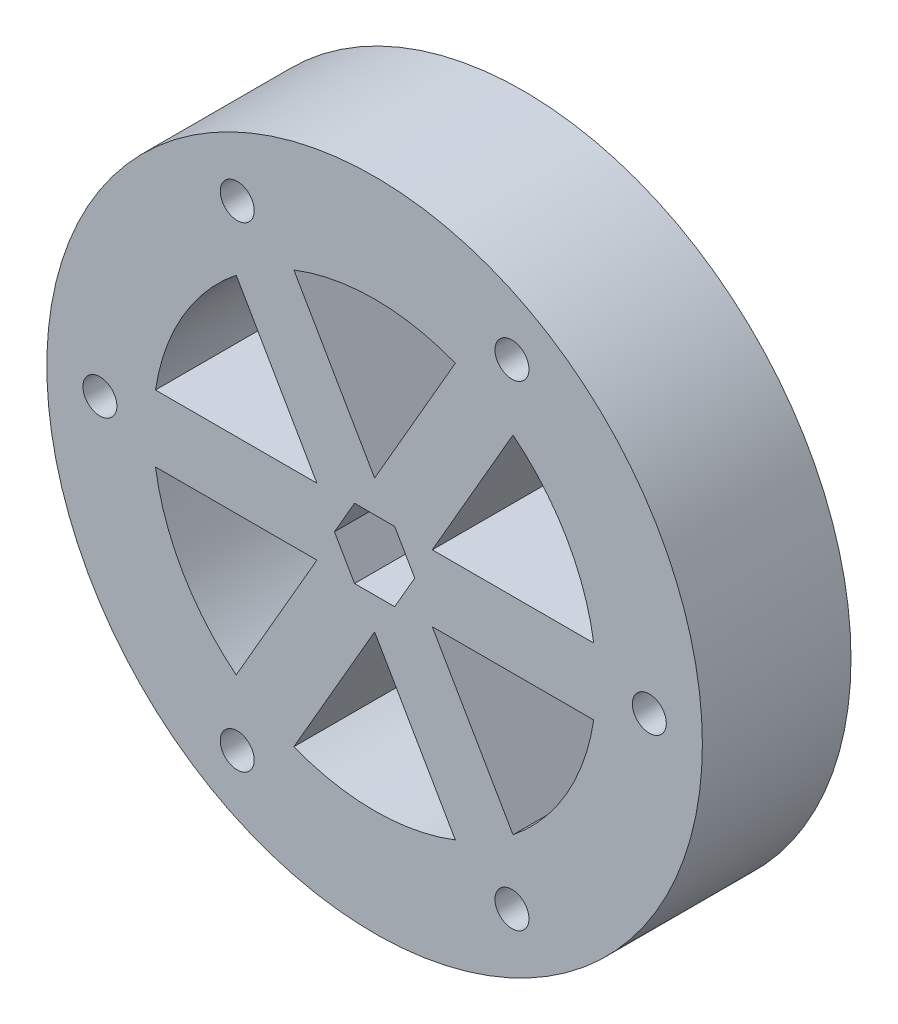
ISO-10303-21;
HEADER;
FILE_DESCRIPTION(('STEP AP214'),'2;1');
FILE_NAME('part.step','',(''),(''),'','','');
FILE_SCHEMA(('AUTOMOTIVE_DESIGN { 1 0 10303 214 1 1 1 1 }'));
ENDSEC;
DATA;
#1=APPLICATION_CONTEXT('core data for automotive mechanical design processes');
#2=APPLICATION_PROTOCOL_DEFINITION('international standard','automotive_design',2000,#1);
#3=PRODUCT_CONTEXT('',#1,'mechanical');
#4=PRODUCT('Part','Part','',(#3));
#5=PRODUCT_RELATED_PRODUCT_CATEGORY('part','',(#4));
#6=PRODUCT_DEFINITION_FORMATION('','',#4);
#7=PRODUCT_DEFINITION_CONTEXT('part definition',#1,'design');
#8=PRODUCT_DEFINITION('design','',#6,#7);
#9=PRODUCT_DEFINITION_SHAPE('','',#8);
#10=(LENGTH_UNIT() NAMED_UNIT(*) SI_UNIT(.MILLI.,.METRE.));
#11=(NAMED_UNIT(*) PLANE_ANGLE_UNIT() SI_UNIT($,.RADIAN.));
#12=(NAMED_UNIT(*) SI_UNIT($,.STERADIAN.) SOLID_ANGLE_UNIT());
#13=UNCERTAINTY_MEASURE_WITH_UNIT(LENGTH_MEASURE(1.E-05),#10,'distance_accuracy_value','');
#14=(GEOMETRIC_REPRESENTATION_CONTEXT(3) GLOBAL_UNCERTAINTY_ASSIGNED_CONTEXT((#13)) GLOBAL_UNIT_ASSIGNED_CONTEXT((#10,
#11,#12)) REPRESENTATION_CONTEXT('',''));
#15=CARTESIAN_POINT('',(0.,0.,0.));
#16=DIRECTION('',(0.,0.,1.));
#17=DIRECTION('',(1.,0.,0.));
#18=AXIS2_PLACEMENT_3D('',#15,#16,#17);
#19=CARTESIAN_POINT('',(0.,0.,14.));
#20=DIRECTION('',(0.,0.,-1.));
#21=DIRECTION('',(-1.,0.,0.));
#22=AXIS2_PLACEMENT_3D('',#19,#20,#21);
#23=CYLINDRICAL_SURFACE('',#22,30.8803961678998);
#24=CARTESIAN_POINT('',(0.,0.,14.));
#25=DIRECTION('',(0.,0.,1.));
#26=DIRECTION('',(1.,0.,0.));
#27=AXIS2_PLACEMENT_3D('',#24,#25,#26);
#28=CIRCLE('',#27,30.8803961678998);
#29=CARTESIAN_POINT('',(30.8803961678998,0.,14.));
#30=VERTEX_POINT('',#29);
#31=EDGE_CURVE('E11',#30,#30,#28,.T.);
#32=ORIENTED_EDGE('',*,*,#31,.F.);
#33=EDGE_LOOP('',(#32));
#34=FACE_BOUND('',#33,.T.);
#35=CARTESIAN_POINT('',(0.,0.,0.));
#36=DIRECTION('',(0.,0.,1.));
#37=DIRECTION('',(1.,0.,0.));
#38=AXIS2_PLACEMENT_3D('',#35,#36,#37);
#39=CIRCLE('',#38,30.8803961678998);
#40=CARTESIAN_POINT('',(30.8803961678998,0.,0.));
#41=VERTEX_POINT('',#40);
#42=EDGE_CURVE('E36',#41,#41,#39,.T.);
#43=ORIENTED_EDGE('',*,*,#42,.T.);
#44=EDGE_LOOP('',(#43));
#45=FACE_BOUND('',#44,.T.);
#46=ADVANCED_FACE('F33',(#34,#45),#23,.T.);
#47=CARTESIAN_POINT('',(0.,0.,14.));
#48=DIRECTION('',(0.,0.,1.));
#49=DIRECTION('',(1.,0.,0.));
#50=AXIS2_PLACEMENT_3D('',#47,#48,#49);
#51=PLANE('',#50);
#52=DIRECTION('',(-1.,0.,0.));
#53=VECTOR('',#52,1.);
#54=CARTESIAN_POINT('',(20.6433291374827,-3.13750000000018,14.));
#55=LINE('',#54,#53);
#56=CARTESIAN_POINT('',(20.6433291374827,-3.13750000000018,14.));
#57=VERTEX_POINT('',#56);
#58=CARTESIAN_POINT('',(5.43430940874733,-3.13750000000003,14.));
#59=VERTEX_POINT('',#58);
#60=EDGE_CURVE('E47',#57,#59,#55,.T.);
#61=ORIENTED_EDGE('',*,*,#60,.F.);
#62=CARTESIAN_POINT('',(0.,0.,14.));
#63=DIRECTION('',(0.,0.,1.));
#64=DIRECTION('',(1.,0.,0.));
#65=AXIS2_PLACEMENT_3D('',#62,#63,#64);
#66=CIRCLE('',#65,20.8803961678998);
#67=CARTESIAN_POINT('',(13.038819273115,-16.3088974517437,14.));
#68=VERTEX_POINT('',#67);
#69=EDGE_CURVE('E229',#68,#57,#66,.T.);
#70=ORIENTED_EDGE('',*,*,#69,.F.);
#71=DIRECTION('',(0.499999999999995,-0.866025403784442,0.));
#72=VECTOR('',#71,1.);
#73=CARTESIAN_POINT('',(5.43430940874733,-3.13750000000003,14.));
#74=LINE('',#73,#72);
#75=EDGE_CURVE('E249',#59,#68,#74,.T.);
#76=ORIENTED_EDGE('',*,*,#75,.F.);
#77=EDGE_LOOP('',(#61,#70,#76));
#78=FACE_BOUND('',#77,.T.);
#79=DIRECTION('',(-0.499999999999995,-0.866025403784441,0.));
#80=VECTOR('',#79,1.);
#81=CARTESIAN_POINT('',(0.,-6.27499999999999,14.));
#82=LINE('',#81,#80);
#83=CARTESIAN_POINT('',(0.,-6.27499999999999,14.));
#84=VERTEX_POINT('',#83);
#85=CARTESIAN_POINT('',(-7.60450986436761,-19.4463974517436,14.));
#86=VERTEX_POINT('',#85);
#87=EDGE_CURVE('E55',#84,#86,#82,.T.);
#88=ORIENTED_EDGE('',*,*,#87,.F.);
#89=DIRECTION('',(-0.500000000000002,0.866025403784438,0.));
#90=VECTOR('',#89,1.);
#91=CARTESIAN_POINT('',(7.60450986436777,-19.4463974517436,14.));
#92=LINE('',#91,#90);
#93=CARTESIAN_POINT('',(7.60450986436777,-19.4463974517436,14.));
#94=VERTEX_POINT('',#93);
#95=EDGE_CURVE('E253',#94,#84,#92,.T.);
#96=ORIENTED_EDGE('',*,*,#95,.F.);
#97=CARTESIAN_POINT('',(0.,0.,14.));
#98=DIRECTION('',(0.,0.,1.));
#99=DIRECTION('',(1.,0.,0.));
#100=AXIS2_PLACEMENT_3D('',#97,#98,#99);
#101=CIRCLE('',#100,20.8803961678998);
#102=EDGE_CURVE('E272',#86,#94,#101,.T.);
#103=ORIENTED_EDGE('',*,*,#102,.F.);
#104=EDGE_LOOP('',(#88,#96,#103));
#105=FACE_BOUND('',#104,.T.);
#106=DIRECTION('',(-0.500000000000006,-0.866025403784435,0.));
#107=VECTOR('',#106,1.);
#108=CARTESIAN_POINT('',(13.0388192731152,16.3088974517435,14.));
#109=LINE('',#108,#107);
#110=CARTESIAN_POINT('',(13.0388192731152,16.3088974517435,14.));
#111=VERTEX_POINT('',#110);
#112=CARTESIAN_POINT('',(5.43430940874736,3.13749999999998,14.));
#113=VERTEX_POINT('',#112);
#114=EDGE_CURVE('E276',#111,#113,#109,.T.);
#115=ORIENTED_EDGE('',*,*,#114,.F.);
#116=CARTESIAN_POINT('',(0.,0.,14.));
#117=DIRECTION('',(0.,0.,1.));
#118=DIRECTION('',(1.,0.,0.));
#119=AXIS2_PLACEMENT_3D('',#116,#117,#118);
#120=CIRCLE('',#119,20.8803961678998);
#121=CARTESIAN_POINT('',(20.6433291374828,3.13749999999992,14.));
#122=VERTEX_POINT('',#121);
#123=EDGE_CURVE('E278',#122,#111,#120,.T.);
#124=ORIENTED_EDGE('',*,*,#123,.F.);
#125=DIRECTION('',(1.,0.,0.));
#126=VECTOR('',#125,1.);
#127=CARTESIAN_POINT('',(5.43430940874736,3.13749999999998,14.));
#128=LINE('',#127,#126);
#129=EDGE_CURVE('E230',#113,#122,#128,.T.);
#130=ORIENTED_EDGE('',*,*,#129,.F.);
#131=EDGE_LOOP('',(#115,#124,#130));
#132=FACE_BOUND('',#131,.T.);
#133=DIRECTION('',(1.,0.,0.));
#134=VECTOR('',#133,1.);
#135=CARTESIAN_POINT('',(-20.6433291374828,3.13750000000003,14.));
#136=LINE('',#135,#134);
#137=CARTESIAN_POINT('',(-20.6433291374828,3.13750000000003,14.));
#138=VERTEX_POINT('',#137);
#139=CARTESIAN_POINT('',(-5.43430940874735,3.13749999999999,14.));
#140=VERTEX_POINT('',#139);
#141=EDGE_CURVE('E212',#138,#140,#136,.T.);
#142=ORIENTED_EDGE('',*,*,#141,.F.);
#143=CARTESIAN_POINT('',(0.,0.,14.));
#144=DIRECTION('',(0.,0.,1.));
#145=DIRECTION('',(1.,0.,0.));
#146=AXIS2_PLACEMENT_3D('',#143,#144,#145);
#147=CIRCLE('',#146,20.8803961678998);
#148=CARTESIAN_POINT('',(-13.0388192731151,16.3088974517436,14.));
#149=VERTEX_POINT('',#148);
#150=EDGE_CURVE('E301',#149,#138,#147,.T.);
#151=ORIENTED_EDGE('',*,*,#150,.F.);
#152=DIRECTION('',(-0.500000000000001,0.866025403784438,0.));
#153=VECTOR('',#152,1.);
#154=CARTESIAN_POINT('',(-5.43430940874735,3.13749999999999,14.));
#155=LINE('',#154,#153);
#156=EDGE_CURVE('E279',#140,#149,#155,.T.);
#157=ORIENTED_EDGE('',*,*,#156,.F.);
#158=EDGE_LOOP('',(#142,#151,#157));
#159=FACE_BOUND('',#158,.T.);
#160=DIRECTION('',(0.500000000000002,-0.866025403784438,0.));
#161=VECTOR('',#160,1.);
#162=CARTESIAN_POINT('',(-7.60450986436777,19.4463974517436,14.));
#163=LINE('',#162,#161);
#164=CARTESIAN_POINT('',(-7.60450986436777,19.4463974517436,14.));
#165=VERTEX_POINT('',#164);
#166=CARTESIAN_POINT('',(0.,6.275,14.));
#167=VERTEX_POINT('',#166);
#168=EDGE_CURVE('E217',#165,#167,#163,.T.);
#169=ORIENTED_EDGE('',*,*,#168,.F.);
#170=CARTESIAN_POINT('',(0.,0.,14.));
#171=DIRECTION('',(0.,0.,1.));
#172=DIRECTION('',(1.,0.,0.));
#173=AXIS2_PLACEMENT_3D('',#170,#171,#172);
#174=CIRCLE('',#173,20.8803961678998);
#175=CARTESIAN_POINT('',(7.6045098643676,19.4463974517436,14.));
#176=VERTEX_POINT('',#175);
#177=EDGE_CURVE('E197',#176,#165,#174,.T.);
#178=ORIENTED_EDGE('',*,*,#177,.F.);
#179=DIRECTION('',(0.499999999999995,0.866025403784441,0.));
#180=VECTOR('',#179,1.);
#181=CARTESIAN_POINT('',(0.,6.27499999999999,14.));
#182=LINE('',#181,#180);
#183=EDGE_CURVE('E209',#167,#176,#182,.T.);
#184=ORIENTED_EDGE('',*,*,#183,.F.);
#185=EDGE_LOOP('',(#169,#178,#184));
#186=FACE_BOUND('',#185,.T.);
#187=DIRECTION('',(-1.,0.,0.));
#188=VECTOR('',#187,1.);
#189=CARTESIAN_POINT('',(-5.43430940874734,-3.13750000000001,14.));
#190=LINE('',#189,#188);
#191=CARTESIAN_POINT('',(-5.43430940874734,-3.13750000000001,14.));
#192=VERTEX_POINT('',#191);
#193=CARTESIAN_POINT('',(-20.6433291374828,-3.13750000000006,14.));
#194=VERTEX_POINT('',#193);
#195=EDGE_CURVE('E275',#192,#194,#190,.T.);
#196=ORIENTED_EDGE('',*,*,#195,.F.);
#197=DIRECTION('',(0.5,0.866025403784439,0.));
#198=VECTOR('',#197,1.);
#199=CARTESIAN_POINT('',(-13.038819273115,-16.3088974517436,14.));
#200=LINE('',#199,#198);
#201=CARTESIAN_POINT('',(-13.038819273115,-16.3088974517436,14.));
#202=VERTEX_POINT('',#201);
#203=EDGE_CURVE('E323',#202,#192,#200,.T.);
#204=ORIENTED_EDGE('',*,*,#203,.F.);
#205=CARTESIAN_POINT('',(0.,0.,14.));
#206=DIRECTION('',(0.,0.,1.));
#207=DIRECTION('',(1.,0.,0.));
#208=AXIS2_PLACEMENT_3D('',#205,#206,#207);
#209=CIRCLE('',#208,20.8803961678998);
#210=EDGE_CURVE('E342',#194,#202,#209,.T.);
#211=ORIENTED_EDGE('',*,*,#210,.F.);
#212=EDGE_LOOP('',(#196,#204,#211));
#213=FACE_BOUND('',#212,.T.);
#214=CARTESIAN_POINT('',(-12.9401980839498,-22.4130805414067,14.));
#215=DIRECTION('',(0.,0.,1.));
#216=DIRECTION('',(1.,0.,0.));
#217=AXIS2_PLACEMENT_3D('',#214,#215,#216);
#218=CIRCLE('',#217,1.6);
#219=CARTESIAN_POINT('',(-11.3401980839498,-22.4130805414067,14.));
#220=VERTEX_POINT('',#219);
#221=EDGE_CURVE('E397',#220,#220,#218,.T.);
#222=ORIENTED_EDGE('',*,*,#221,.F.);
#223=EDGE_LOOP('',(#222));
#224=FACE_BOUND('',#223,.T.);
#225=CARTESIAN_POINT('',(-25.8803961678998,-2.70616862252382E-13,14.));
#226=DIRECTION('',(0.,0.,1.));
#227=DIRECTION('',(1.,0.,0.));
#228=AXIS2_PLACEMENT_3D('',#225,#226,#227);
#229=CIRCLE('',#228,1.6);
#230=CARTESIAN_POINT('',(-24.2803961678998,-2.70616862252382E-13,14.));
#231=VERTEX_POINT('',#230);
#232=EDGE_CURVE('E404',#231,#231,#229,.T.);
#233=ORIENTED_EDGE('',*,*,#232,.F.);
#234=EDGE_LOOP('',(#233));
#235=FACE_BOUND('',#234,.T.);
#236=CARTESIAN_POINT('',(-12.9401980839499,22.4130805414067,14.));
#237=DIRECTION('',(0.,0.,1.));
#238=DIRECTION('',(1.,0.,0.));
#239=AXIS2_PLACEMENT_3D('',#236,#237,#238);
#240=CIRCLE('',#239,1.6);
#241=CARTESIAN_POINT('',(-11.3401980839499,22.4130805414067,14.));
#242=VERTEX_POINT('',#241);
#243=EDGE_CURVE('E410',#242,#242,#240,.T.);
#244=ORIENTED_EDGE('',*,*,#243,.F.);
#245=EDGE_LOOP('',(#244));
#246=FACE_BOUND('',#245,.T.);
#247=CARTESIAN_POINT('',(12.9401980839499,22.4130805414067,14.));
#248=DIRECTION('',(0.,0.,1.));
#249=DIRECTION('',(1.,0.,0.));
#250=AXIS2_PLACEMENT_3D('',#247,#248,#249);
#251=CIRCLE('',#250,1.6);
#252=CARTESIAN_POINT('',(14.5401980839499,22.4130805414067,14.));
#253=VERTEX_POINT('',#252);
#254=EDGE_CURVE('E416',#253,#253,#251,.T.);
#255=ORIENTED_EDGE('',*,*,#254,.F.);
#256=EDGE_LOOP('',(#255));
#257=FACE_BOUND('',#256,.T.);
#258=CARTESIAN_POINT('',(25.8803961678998,2.70616862252382E-13,14.));
#259=DIRECTION('',(0.,0.,1.));
#260=DIRECTION('',(1.,0.,0.));
#261=AXIS2_PLACEMENT_3D('',#258,#259,#260);
#262=CIRCLE('',#261,1.6);
#263=CARTESIAN_POINT('',(27.4803961678998,2.70616862252382E-13,14.));
#264=VERTEX_POINT('',#263);
#265=EDGE_CURVE('E346',#264,#264,#262,.T.);
#266=ORIENTED_EDGE('',*,*,#265,.F.);
#267=EDGE_LOOP('',(#266));
#268=FACE_BOUND('',#267,.T.);
#269=DIRECTION('',(1.,0.,0.));
#270=VECTOR('',#269,1.);
#271=CARTESIAN_POINT('',(-1.89082213159602,-3.275,14.));
#272=LINE('',#271,#270);
#273=CARTESIAN_POINT('',(-1.89082213159602,-3.275,14.));
#274=VERTEX_POINT('',#273);
#275=CARTESIAN_POINT('',(1.89082213159603,-3.275,14.));
#276=VERTEX_POINT('',#275);
#277=EDGE_CURVE('E356',#274,#276,#272,.T.);
#278=ORIENTED_EDGE('',*,*,#277,.F.);
#279=DIRECTION('',(0.500000000000002,-0.866025403784437,0.));
#280=VECTOR('',#279,1.);
#281=CARTESIAN_POINT('',(-3.78164426319205,0.,14.));
#282=LINE('',#281,#280);
#283=CARTESIAN_POINT('',(-3.78164426319205,0.,14.));
#284=VERTEX_POINT('',#283);
#285=EDGE_CURVE('E354',#284,#274,#282,.T.);
#286=ORIENTED_EDGE('',*,*,#285,.F.);
#287=DIRECTION('',(-0.499999999999998,-0.866025403784439,0.));
#288=VECTOR('',#287,1.);
#289=CARTESIAN_POINT('',(-1.89082213159603,3.275,14.));
#290=LINE('',#289,#288);
#291=CARTESIAN_POINT('',(-1.89082213159603,3.275,14.));
#292=VERTEX_POINT('',#291);
#293=EDGE_CURVE('E366',#292,#284,#290,.T.);
#294=ORIENTED_EDGE('',*,*,#293,.F.);
#295=DIRECTION('',(-1.,0.,0.));
#296=VECTOR('',#295,1.);
#297=CARTESIAN_POINT('',(1.89082213159601,3.275,14.));
#298=LINE('',#297,#296);
#299=CARTESIAN_POINT('',(1.89082213159601,3.275,14.));
#300=VERTEX_POINT('',#299);
#301=EDGE_CURVE('E363',#300,#292,#298,.T.);
#302=ORIENTED_EDGE('',*,*,#301,.F.);
#303=DIRECTION('',(-0.500000000000002,0.866025403784437,0.));
#304=VECTOR('',#303,1.);
#305=CARTESIAN_POINT('',(3.78164426319204,0.,14.));
#306=LINE('',#305,#304);
#307=CARTESIAN_POINT('',(3.78164426319204,0.,14.));
#308=VERTEX_POINT('',#307);
#309=EDGE_CURVE('E361',#308,#300,#306,.T.);
#310=ORIENTED_EDGE('',*,*,#309,.F.);
#311=DIRECTION('',(0.499999999999997,0.86602540378444,0.));
#312=VECTOR('',#311,1.);
#313=CARTESIAN_POINT('',(1.89082213159603,-3.275,14.));
#314=LINE('',#313,#312);
#315=EDGE_CURVE('E359',#276,#308,#314,.T.);
#316=ORIENTED_EDGE('',*,*,#315,.F.);
#317=EDGE_LOOP('',(#278,#286,#294,#302,#310,#316));
#318=FACE_BOUND('',#317,.T.);
#319=CARTESIAN_POINT('',(12.9401980839501,-22.4130805414066,14.));
#320=DIRECTION('',(0.,0.,1.));
#321=DIRECTION('',(1.,0.,0.));
#322=AXIS2_PLACEMENT_3D('',#319,#320,#321);
#323=CIRCLE('',#322,1.6);
#324=CARTESIAN_POINT('',(14.5401980839501,-22.4130805414066,14.));
#325=VERTEX_POINT('',#324);
#326=EDGE_CURVE('E421',#325,#325,#323,.T.);
#327=ORIENTED_EDGE('',*,*,#326,.F.);
#328=EDGE_LOOP('',(#327));
#329=FACE_BOUND('',#328,.T.);
#330=ORIENTED_EDGE('',*,*,#31,.T.);
#331=EDGE_LOOP('',(#330));
#332=FACE_BOUND('',#331,.T.);
#333=ADVANCED_FACE('F215',(#78,#105,#132,#159,#186,#213,#224,#235,#246,#257,#268,#318,#329,
#332),#51,.T.);
#334=CARTESIAN_POINT('',(0.,0.,0.));
#335=DIRECTION('',(0.,0.,1.));
#336=DIRECTION('',(1.,0.,0.));
#337=AXIS2_PLACEMENT_3D('',#334,#335,#336);
#338=PLANE('',#337);
#339=CARTESIAN_POINT('',(0.,0.,0.));
#340=DIRECTION('',(0.,0.,1.));
#341=DIRECTION('',(1.,0.,0.));
#342=AXIS2_PLACEMENT_3D('',#339,#340,#341);
#343=CIRCLE('',#342,20.8803961678998);
#344=CARTESIAN_POINT('',(13.038819273115,-16.3088974517437,0.));
#345=VERTEX_POINT('',#344);
#346=CARTESIAN_POINT('',(20.6433291374827,-3.13750000000018,0.));
#347=VERTEX_POINT('',#346);
#348=EDGE_CURVE('E233',#345,#347,#343,.T.);
#349=ORIENTED_EDGE('',*,*,#348,.T.);
#350=DIRECTION('',(-1.,0.,0.));
#351=VECTOR('',#350,1.);
#352=CARTESIAN_POINT('',(20.6433291374827,-3.13750000000018,0.));
#353=LINE('',#352,#351);
#354=CARTESIAN_POINT('',(5.43430940874733,-3.13750000000003,0.));
#355=VERTEX_POINT('',#354);
#356=EDGE_CURVE('E236',#347,#355,#353,.T.);
#357=ORIENTED_EDGE('',*,*,#356,.T.);
#358=DIRECTION('',(0.499999999999995,-0.866025403784442,0.));
#359=VECTOR('',#358,1.);
#360=CARTESIAN_POINT('',(5.43430940874733,-3.13750000000003,0.));
#361=LINE('',#360,#359);
#362=EDGE_CURVE('E239',#355,#345,#361,.T.);
#363=ORIENTED_EDGE('',*,*,#362,.T.);
#364=EDGE_LOOP('',(#349,#357,#363));
#365=FACE_BOUND('',#364,.T.);
#366=DIRECTION('',(-0.500000000000002,0.866025403784438,0.));
#367=VECTOR('',#366,1.);
#368=CARTESIAN_POINT('',(7.60450986436777,-19.4463974517436,0.));
#369=LINE('',#368,#367);
#370=CARTESIAN_POINT('',(7.60450986436777,-19.4463974517436,0.));
#371=VERTEX_POINT('',#370);
#372=CARTESIAN_POINT('',(0.,-6.27499999999999,0.));
#373=VERTEX_POINT('',#372);
#374=EDGE_CURVE('E256',#371,#373,#369,.T.);
#375=ORIENTED_EDGE('',*,*,#374,.T.);
#376=DIRECTION('',(-0.499999999999995,-0.866025403784441,0.));
#377=VECTOR('',#376,1.);
#378=CARTESIAN_POINT('',(0.,-6.27499999999999,0.));
#379=LINE('',#378,#377);
#380=CARTESIAN_POINT('',(-7.6045098643676,-19.4463974517436,0.));
#381=VERTEX_POINT('',#380);
#382=EDGE_CURVE('E259',#373,#381,#379,.T.);
#383=ORIENTED_EDGE('',*,*,#382,.T.);
#384=CARTESIAN_POINT('',(0.,0.,0.));
#385=DIRECTION('',(0.,0.,1.));
#386=DIRECTION('',(1.,0.,0.));
#387=AXIS2_PLACEMENT_3D('',#384,#385,#386);
#388=CIRCLE('',#387,20.8803961678998);
#389=EDGE_CURVE('E262',#381,#371,#388,.T.);
#390=ORIENTED_EDGE('',*,*,#389,.T.);
#391=EDGE_LOOP('',(#375,#383,#390));
#392=FACE_BOUND('',#391,.T.);
#393=CARTESIAN_POINT('',(0.,0.,0.));
#394=DIRECTION('',(0.,0.,1.));
#395=DIRECTION('',(1.,0.,0.));
#396=AXIS2_PLACEMENT_3D('',#393,#394,#395);
#397=CIRCLE('',#396,20.8803961678998);
#398=CARTESIAN_POINT('',(20.6433291374828,3.13749999999992,0.));
#399=VERTEX_POINT('',#398);
#400=CARTESIAN_POINT('',(13.0388192731152,16.3088974517435,0.));
#401=VERTEX_POINT('',#400);
#402=EDGE_CURVE('E282',#399,#401,#397,.T.);
#403=ORIENTED_EDGE('',*,*,#402,.T.);
#404=DIRECTION('',(-0.500000000000006,-0.866025403784435,0.));
#405=VECTOR('',#404,1.);
#406=CARTESIAN_POINT('',(13.0388192731152,16.3088974517435,0.));
#407=LINE('',#406,#405);
#408=CARTESIAN_POINT('',(5.43430940874736,3.13749999999998,0.));
#409=VERTEX_POINT('',#408);
#410=EDGE_CURVE('E285',#401,#409,#407,.T.);
#411=ORIENTED_EDGE('',*,*,#410,.T.);
#412=DIRECTION('',(1.,0.,0.));
#413=VECTOR('',#412,1.);
#414=CARTESIAN_POINT('',(5.43430940874736,3.13749999999998,0.));
#415=LINE('',#414,#413);
#416=EDGE_CURVE('E288',#409,#399,#415,.T.);
#417=ORIENTED_EDGE('',*,*,#416,.T.);
#418=EDGE_LOOP('',(#403,#411,#417));
#419=FACE_BOUND('',#418,.T.);
#420=CARTESIAN_POINT('',(0.,0.,0.));
#421=DIRECTION('',(0.,0.,1.));
#422=DIRECTION('',(1.,0.,0.));
#423=AXIS2_PLACEMENT_3D('',#420,#421,#422);
#424=CIRCLE('',#423,20.8803961678998);
#425=CARTESIAN_POINT('',(-13.0388192731151,16.3088974517436,0.));
#426=VERTEX_POINT('',#425);
#427=CARTESIAN_POINT('',(-20.6433291374828,3.13750000000003,0.));
#428=VERTEX_POINT('',#427);
#429=EDGE_CURVE('E304',#426,#428,#424,.T.);
#430=ORIENTED_EDGE('',*,*,#429,.T.);
#431=DIRECTION('',(1.,0.,0.));
#432=VECTOR('',#431,1.);
#433=CARTESIAN_POINT('',(-20.6433291374828,3.13750000000003,0.));
#434=LINE('',#433,#432);
#435=CARTESIAN_POINT('',(-5.43430940874735,3.13749999999999,0.));
#436=VERTEX_POINT('',#435);
#437=EDGE_CURVE('E307',#428,#436,#434,.T.);
#438=ORIENTED_EDGE('',*,*,#437,.T.);
#439=DIRECTION('',(-0.500000000000001,0.866025403784438,0.));
#440=VECTOR('',#439,1.);
#441=CARTESIAN_POINT('',(-5.43430940874735,3.13749999999999,0.));
#442=LINE('',#441,#440);
#443=EDGE_CURVE('E310',#436,#426,#442,.T.);
#444=ORIENTED_EDGE('',*,*,#443,.T.);
#445=EDGE_LOOP('',(#430,#438,#444));
#446=FACE_BOUND('',#445,.T.);
#447=CARTESIAN_POINT('',(0.,0.,0.));
#448=DIRECTION('',(0.,0.,1.));
#449=DIRECTION('',(1.,0.,0.));
#450=AXIS2_PLACEMENT_3D('',#447,#448,#449);
#451=CIRCLE('',#450,20.8803961678998);
#452=CARTESIAN_POINT('',(7.60450986436761,19.4463974517436,0.));
#453=VERTEX_POINT('',#452);
#454=CARTESIAN_POINT('',(-7.60450986436777,19.4463974517436,0.));
#455=VERTEX_POINT('',#454);
#456=EDGE_CURVE('E200',#453,#455,#451,.T.);
#457=ORIENTED_EDGE('',*,*,#456,.T.);
#458=DIRECTION('',(0.500000000000002,-0.866025403784438,0.));
#459=VECTOR('',#458,1.);
#460=CARTESIAN_POINT('',(-7.60450986436777,19.4463974517436,0.));
#461=LINE('',#460,#459);
#462=CARTESIAN_POINT('',(0.,6.27499999999999,0.));
#463=VERTEX_POINT('',#462);
#464=EDGE_CURVE('E219',#455,#463,#461,.T.);
#465=ORIENTED_EDGE('',*,*,#464,.T.);
#466=DIRECTION('',(0.499999999999995,0.866025403784441,0.));
#467=VECTOR('',#466,1.);
#468=CARTESIAN_POINT('',(0.,6.27499999999999,0.));
#469=LINE('',#468,#467);
#470=EDGE_CURVE('E205',#463,#453,#469,.T.);
#471=ORIENTED_EDGE('',*,*,#470,.T.);
#472=EDGE_LOOP('',(#457,#465,#471));
#473=FACE_BOUND('',#472,.T.);
#474=DIRECTION('',(0.5,0.866025403784438,0.));
#475=VECTOR('',#474,1.);
#476=CARTESIAN_POINT('',(-13.038819273115,-16.3088974517436,0.));
#477=LINE('',#476,#475);
#478=CARTESIAN_POINT('',(-13.038819273115,-16.3088974517436,0.));
#479=VERTEX_POINT('',#478);
#480=CARTESIAN_POINT('',(-5.43430940874734,-3.13750000000001,0.));
#481=VERTEX_POINT('',#480);
#482=EDGE_CURVE('E326',#479,#481,#477,.T.);
#483=ORIENTED_EDGE('',*,*,#482,.T.);
#484=DIRECTION('',(-1.,0.,0.));
#485=VECTOR('',#484,1.);
#486=CARTESIAN_POINT('',(-5.43430940874734,-3.13750000000001,0.));
#487=LINE('',#486,#485);
#488=CARTESIAN_POINT('',(-20.6433291374828,-3.13750000000006,0.));
#489=VERTEX_POINT('',#488);
#490=EDGE_CURVE('E329',#481,#489,#487,.T.);
#491=ORIENTED_EDGE('',*,*,#490,.T.);
#492=CARTESIAN_POINT('',(0.,0.,0.));
#493=DIRECTION('',(0.,0.,1.));
#494=DIRECTION('',(1.,0.,0.));
#495=AXIS2_PLACEMENT_3D('',#492,#493,#494);
#496=CIRCLE('',#495,20.8803961678998);
#497=EDGE_CURVE('E332',#489,#479,#496,.T.);
#498=ORIENTED_EDGE('',*,*,#497,.T.);
#499=EDGE_LOOP('',(#483,#491,#498));
#500=FACE_BOUND('',#499,.T.);
#501=CARTESIAN_POINT('',(-12.9401980839498,-22.4130805414067,0.));
#502=DIRECTION('',(0.,0.,1.));
#503=DIRECTION('',(1.,0.,0.));
#504=AXIS2_PLACEMENT_3D('',#501,#502,#503);
#505=CIRCLE('',#504,1.6);
#506=CARTESIAN_POINT('',(-11.3401980839498,-22.4130805414067,0.));
#507=VERTEX_POINT('',#506);
#508=EDGE_CURVE('E401',#507,#507,#505,.T.);
#509=ORIENTED_EDGE('',*,*,#508,.T.);
#510=EDGE_LOOP('',(#509));
#511=FACE_BOUND('',#510,.T.);
#512=CARTESIAN_POINT('',(-25.8803961678998,-2.70616862252382E-13,0.));
#513=DIRECTION('',(0.,0.,1.));
#514=DIRECTION('',(1.,0.,0.));
#515=AXIS2_PLACEMENT_3D('',#512,#513,#514);
#516=CIRCLE('',#515,1.6);
#517=CARTESIAN_POINT('',(-24.2803961678998,-2.70616862252382E-13,0.));
#518=VERTEX_POINT('',#517);
#519=EDGE_CURVE('E407',#518,#518,#516,.T.);
#520=ORIENTED_EDGE('',*,*,#519,.T.);
#521=EDGE_LOOP('',(#520));
#522=FACE_BOUND('',#521,.T.);
#523=CARTESIAN_POINT('',(-12.9401980839499,22.4130805414067,0.));
#524=DIRECTION('',(0.,0.,1.));
#525=DIRECTION('',(1.,0.,0.));
#526=AXIS2_PLACEMENT_3D('',#523,#524,#525);
#527=CIRCLE('',#526,1.6);
#528=CARTESIAN_POINT('',(-11.3401980839499,22.4130805414067,0.));
#529=VERTEX_POINT('',#528);
#530=EDGE_CURVE('E413',#529,#529,#527,.T.);
#531=ORIENTED_EDGE('',*,*,#530,.T.);
#532=EDGE_LOOP('',(#531));
#533=FACE_BOUND('',#532,.T.);
#534=CARTESIAN_POINT('',(12.9401980839499,22.4130805414067,0.));
#535=DIRECTION('',(0.,0.,1.));
#536=DIRECTION('',(1.,0.,0.));
#537=AXIS2_PLACEMENT_3D('',#534,#535,#536);
#538=CIRCLE('',#537,1.6);
#539=CARTESIAN_POINT('',(14.5401980839499,22.4130805414067,0.));
#540=VERTEX_POINT('',#539);
#541=EDGE_CURVE('E349',#540,#540,#538,.T.);
#542=ORIENTED_EDGE('',*,*,#541,.T.);
#543=EDGE_LOOP('',(#542));
#544=FACE_BOUND('',#543,.T.);
#545=CARTESIAN_POINT('',(25.8803961678998,2.70616862252382E-13,0.));
#546=DIRECTION('',(0.,0.,1.));
#547=DIRECTION('',(1.,0.,0.));
#548=AXIS2_PLACEMENT_3D('',#545,#546,#547);
#549=CIRCLE('',#548,1.6);
#550=CARTESIAN_POINT('',(27.4803961678998,2.70616862252382E-13,0.));
#551=VERTEX_POINT('',#550);
#552=EDGE_CURVE('E350',#551,#551,#549,.T.);
#553=ORIENTED_EDGE('',*,*,#552,.T.);
#554=EDGE_LOOP('',(#553));
#555=FACE_BOUND('',#554,.T.);
#556=DIRECTION('',(0.500000000000002,-0.866025403784437,0.));
#557=VECTOR('',#556,1.);
#558=CARTESIAN_POINT('',(-3.78164426319205,0.,0.));
#559=LINE('',#558,#557);
#560=CARTESIAN_POINT('',(-3.78164426319205,0.,0.));
#561=VERTEX_POINT('',#560);
#562=CARTESIAN_POINT('',(-1.89082213159602,-3.275,0.));
#563=VERTEX_POINT('',#562);
#564=EDGE_CURVE('E345',#561,#563,#559,.T.);
#565=ORIENTED_EDGE('',*,*,#564,.T.);
#566=DIRECTION('',(1.,0.,0.));
#567=VECTOR('',#566,1.);
#568=CARTESIAN_POINT('',(-1.89082213159602,-3.275,0.));
#569=LINE('',#568,#567);
#570=CARTESIAN_POINT('',(1.89082213159603,-3.275,0.));
#571=VERTEX_POINT('',#570);
#572=EDGE_CURVE('E371',#563,#571,#569,.T.);
#573=ORIENTED_EDGE('',*,*,#572,.T.);
#574=DIRECTION('',(0.499999999999997,0.86602540378444,0.));
#575=VECTOR('',#574,1.);
#576=CARTESIAN_POINT('',(1.89082213159603,-3.275,0.));
#577=LINE('',#576,#575);
#578=CARTESIAN_POINT('',(3.78164426319204,0.,0.));
#579=VERTEX_POINT('',#578);
#580=EDGE_CURVE('E374',#571,#579,#577,.T.);
#581=ORIENTED_EDGE('',*,*,#580,.T.);
#582=DIRECTION('',(-0.500000000000002,0.866025403784437,0.));
#583=VECTOR('',#582,1.);
#584=CARTESIAN_POINT('',(3.78164426319204,0.,0.));
#585=LINE('',#584,#583);
#586=CARTESIAN_POINT('',(1.89082213159601,3.275,0.));
#587=VERTEX_POINT('',#586);
#588=EDGE_CURVE('E377',#579,#587,#585,.T.);
#589=ORIENTED_EDGE('',*,*,#588,.T.);
#590=DIRECTION('',(-1.,0.,0.));
#591=VECTOR('',#590,1.);
#592=CARTESIAN_POINT('',(1.89082213159601,3.275,0.));
#593=LINE('',#592,#591);
#594=CARTESIAN_POINT('',(-1.89082213159603,3.275,0.));
#595=VERTEX_POINT('',#594);
#596=EDGE_CURVE('E380',#587,#595,#593,.T.);
#597=ORIENTED_EDGE('',*,*,#596,.T.);
#598=DIRECTION('',(-0.499999999999998,-0.866025403784439,0.));
#599=VECTOR('',#598,1.);
#600=CARTESIAN_POINT('',(-1.89082213159603,3.275,0.));
#601=LINE('',#600,#599);
#602=EDGE_CURVE('E357',#595,#561,#601,.T.);
#603=ORIENTED_EDGE('',*,*,#602,.T.);
#604=EDGE_LOOP('',(#565,#573,#581,#589,#597,#603));
#605=FACE_BOUND('',#604,.T.);
#606=CARTESIAN_POINT('',(12.9401980839501,-22.4130805414066,0.));
#607=DIRECTION('',(0.,0.,1.));
#608=DIRECTION('',(1.,0.,0.));
#609=AXIS2_PLACEMENT_3D('',#606,#607,#608);
#610=CIRCLE('',#609,1.6);
#611=CARTESIAN_POINT('',(14.5401980839501,-22.4130805414066,0.));
#612=VERTEX_POINT('',#611);
#613=EDGE_CURVE('E400',#612,#612,#610,.T.);
#614=ORIENTED_EDGE('',*,*,#613,.T.);
#615=EDGE_LOOP('',(#614));
#616=FACE_BOUND('',#615,.T.);
#617=ORIENTED_EDGE('',*,*,#42,.F.);
#618=EDGE_LOOP('',(#617));
#619=FACE_BOUND('',#618,.T.);
#620=ADVANCED_FACE('F427',(#365,#392,#419,#446,#473,#500,#511,#522,#533,#544,#555,#605,#616,
#619),#338,.F.);
#621=CARTESIAN_POINT('',(12.9401980839501,-22.4130805414066,14.));
#622=DIRECTION('',(0.,0.,-1.));
#623=DIRECTION('',(-1.,0.,0.));
#624=AXIS2_PLACEMENT_3D('',#621,#622,#623);
#625=CYLINDRICAL_SURFACE('',#624,1.6);
#626=ORIENTED_EDGE('',*,*,#326,.T.);
#627=EDGE_LOOP('',(#626));
#628=FACE_BOUND('',#627,.T.);
#629=ORIENTED_EDGE('',*,*,#613,.F.);
#630=EDGE_LOOP('',(#629));
#631=FACE_BOUND('',#630,.T.);
#632=ADVANCED_FACE('F430',(#628,#631),#625,.F.);
#633=CARTESIAN_POINT('',(-3.78164426319205,0.,14.));
#634=DIRECTION('',(0.866025403784437,0.500000000000002,0.));
#635=DIRECTION('',(-0.500000000000002,0.866025403784438,0.));
#636=AXIS2_PLACEMENT_3D('',#633,#634,#635);
#637=PLANE('',#636);
#638=ORIENTED_EDGE('',*,*,#564,.F.);
#639=DIRECTION('',(0.,0.,-1.));
#640=VECTOR('',#639,1.);
#641=CARTESIAN_POINT('',(-3.78164426319205,0.,14.));
#642=LINE('',#641,#640);
#643=EDGE_CURVE('E368',#284,#561,#642,.T.);
#644=ORIENTED_EDGE('',*,*,#643,.F.);
#645=ORIENTED_EDGE('',*,*,#285,.T.);
#646=DIRECTION('',(0.,0.,-1.));
#647=VECTOR('',#646,1.);
#648=CARTESIAN_POINT('',(-1.89082213159602,-3.275,14.));
#649=LINE('',#648,#647);
#650=EDGE_CURVE('E353',#274,#563,#649,.T.);
#651=ORIENTED_EDGE('',*,*,#650,.T.);
#652=EDGE_LOOP('',(#638,#644,#645,#651));
#653=FACE_BOUND('',#652,.T.);
#654=ADVANCED_FACE('F432',(#653),#637,.T.);
#655=CARTESIAN_POINT('',(-1.89082213159602,-3.275,14.));
#656=DIRECTION('',(0.,1.,0.));
#657=DIRECTION('',(-1.,0.,0.));
#658=AXIS2_PLACEMENT_3D('',#655,#656,#657);
#659=PLANE('',#658);
#660=ORIENTED_EDGE('',*,*,#572,.F.);
#661=ORIENTED_EDGE('',*,*,#650,.F.);
#662=ORIENTED_EDGE('',*,*,#277,.T.);
#663=DIRECTION('',(0.,0.,-1.));
#664=VECTOR('',#663,1.);
#665=CARTESIAN_POINT('',(1.89082213159603,-3.275,14.));
#666=LINE('',#665,#664);
#667=EDGE_CURVE('E393',#276,#571,#666,.T.);
#668=ORIENTED_EDGE('',*,*,#667,.T.);
#669=EDGE_LOOP('',(#660,#661,#662,#668));
#670=FACE_BOUND('',#669,.T.);
#671=ADVANCED_FACE('F439',(#670),#659,.T.);
#672=CARTESIAN_POINT('',(1.89082213159603,-3.275,14.));
#673=DIRECTION('',(-0.86602540378444,0.499999999999997,0.));
#674=DIRECTION('',(-0.499999999999997,-0.866025403784441,0.));
#675=AXIS2_PLACEMENT_3D('',#672,#673,#674);
#676=PLANE('',#675);
#677=ORIENTED_EDGE('',*,*,#580,.F.);
#678=ORIENTED_EDGE('',*,*,#667,.F.);
#679=ORIENTED_EDGE('',*,*,#315,.T.);
#680=DIRECTION('',(0.,0.,-1.));
#681=VECTOR('',#680,1.);
#682=CARTESIAN_POINT('',(3.78164426319204,0.,14.));
#683=LINE('',#682,#681);
#684=EDGE_CURVE('E391',#308,#579,#683,.T.);
#685=ORIENTED_EDGE('',*,*,#684,.T.);
#686=EDGE_LOOP('',(#677,#678,#679,#685));
#687=FACE_BOUND('',#686,.T.);
#688=ADVANCED_FACE('F522',(#687),#676,.T.);
#689=CARTESIAN_POINT('',(3.78164426319204,0.,14.));
#690=DIRECTION('',(-0.866025403784437,-0.500000000000002,0.));
#691=DIRECTION('',(0.500000000000002,-0.866025403784437,0.));
#692=AXIS2_PLACEMENT_3D('',#689,#690,#691);
#693=PLANE('',#692);
#694=ORIENTED_EDGE('',*,*,#588,.F.);
#695=ORIENTED_EDGE('',*,*,#684,.F.);
#696=ORIENTED_EDGE('',*,*,#309,.T.);
#697=DIRECTION('',(0.,0.,-1.));
#698=VECTOR('',#697,1.);
#699=CARTESIAN_POINT('',(1.89082213159601,3.275,14.));
#700=LINE('',#699,#698);
#701=EDGE_CURVE('E389',#300,#587,#700,.T.);
#702=ORIENTED_EDGE('',*,*,#701,.T.);
#703=EDGE_LOOP('',(#694,#695,#696,#702));
#704=FACE_BOUND('',#703,.T.);
#705=ADVANCED_FACE('F518',(#704),#693,.T.);
#706=CARTESIAN_POINT('',(1.89082213159601,3.275,14.));
#707=DIRECTION('',(0.,-1.,0.));
#708=DIRECTION('',(1.,0.,0.));
#709=AXIS2_PLACEMENT_3D('',#706,#707,#708);
#710=PLANE('',#709);
#711=ORIENTED_EDGE('',*,*,#596,.F.);
#712=ORIENTED_EDGE('',*,*,#701,.F.);
#713=ORIENTED_EDGE('',*,*,#301,.T.);
#714=DIRECTION('',(0.,0.,-1.));
#715=VECTOR('',#714,1.);
#716=CARTESIAN_POINT('',(-1.89082213159603,3.275,14.));
#717=LINE('',#716,#715);
#718=EDGE_CURVE('E387',#292,#595,#717,.T.);
#719=ORIENTED_EDGE('',*,*,#718,.T.);
#720=EDGE_LOOP('',(#711,#712,#713,#719));
#721=FACE_BOUND('',#720,.T.);
#722=ADVANCED_FACE('F514',(#721),#710,.T.);
#723=CARTESIAN_POINT('',(-1.89082213159603,3.275,14.));
#724=DIRECTION('',(0.86602540378444,-0.499999999999998,0.));
#725=DIRECTION('',(0.499999999999998,0.86602540378444,0.));
#726=AXIS2_PLACEMENT_3D('',#723,#724,#725);
#727=PLANE('',#726);
#728=ORIENTED_EDGE('',*,*,#602,.F.);
#729=ORIENTED_EDGE('',*,*,#718,.F.);
#730=ORIENTED_EDGE('',*,*,#293,.T.);
#731=ORIENTED_EDGE('',*,*,#643,.T.);
#732=EDGE_LOOP('',(#728,#729,#730,#731));
#733=FACE_BOUND('',#732,.T.);
#734=ADVANCED_FACE('F510',(#733),#727,.T.);
#735=CARTESIAN_POINT('',(25.8803961678998,2.70616862252382E-13,14.));
#736=DIRECTION('',(0.,0.,-1.));
#737=DIRECTION('',(-1.,0.,0.));
#738=AXIS2_PLACEMENT_3D('',#735,#736,#737);
#739=CYLINDRICAL_SURFACE('',#738,1.6);
#740=ORIENTED_EDGE('',*,*,#265,.T.);
#741=EDGE_LOOP('',(#740));
#742=FACE_BOUND('',#741,.T.);
#743=ORIENTED_EDGE('',*,*,#552,.F.);
#744=EDGE_LOOP('',(#743));
#745=FACE_BOUND('',#744,.T.);
#746=ADVANCED_FACE('F506',(#742,#745),#739,.F.);
#747=CARTESIAN_POINT('',(12.9401980839499,22.4130805414067,14.));
#748=DIRECTION('',(0.,0.,-1.));
#749=DIRECTION('',(-1.,0.,0.));
#750=AXIS2_PLACEMENT_3D('',#747,#748,#749);
#751=CYLINDRICAL_SURFACE('',#750,1.6);
#752=ORIENTED_EDGE('',*,*,#254,.T.);
#753=EDGE_LOOP('',(#752));
#754=FACE_BOUND('',#753,.T.);
#755=ORIENTED_EDGE('',*,*,#541,.F.);
#756=EDGE_LOOP('',(#755));
#757=FACE_BOUND('',#756,.T.);
#758=ADVANCED_FACE('F509',(#754,#757),#751,.F.);
#759=CARTESIAN_POINT('',(-12.9401980839499,22.4130805414067,14.));
#760=DIRECTION('',(0.,0.,-1.));
#761=DIRECTION('',(-1.,0.,0.));
#762=AXIS2_PLACEMENT_3D('',#759,#760,#761);
#763=CYLINDRICAL_SURFACE('',#762,1.6);
#764=ORIENTED_EDGE('',*,*,#243,.T.);
#765=EDGE_LOOP('',(#764));
#766=FACE_BOUND('',#765,.T.);
#767=ORIENTED_EDGE('',*,*,#530,.F.);
#768=EDGE_LOOP('',(#767));
#769=FACE_BOUND('',#768,.T.);
#770=ADVANCED_FACE('F536',(#766,#769),#763,.F.);
#771=CARTESIAN_POINT('',(-25.8803961678998,-2.70616862252382E-13,14.));
#772=DIRECTION('',(0.,0.,-1.));
#773=DIRECTION('',(-1.,0.,0.));
#774=AXIS2_PLACEMENT_3D('',#771,#772,#773);
#775=CYLINDRICAL_SURFACE('',#774,1.6);
#776=ORIENTED_EDGE('',*,*,#232,.T.);
#777=EDGE_LOOP('',(#776));
#778=FACE_BOUND('',#777,.T.);
#779=ORIENTED_EDGE('',*,*,#519,.F.);
#780=EDGE_LOOP('',(#779));
#781=FACE_BOUND('',#780,.T.);
#782=ADVANCED_FACE('F532',(#778,#781),#775,.F.);
#783=CARTESIAN_POINT('',(-12.9401980839498,-22.4130805414067,14.));
#784=DIRECTION('',(0.,0.,-1.));
#785=DIRECTION('',(-1.,0.,0.));
#786=AXIS2_PLACEMENT_3D('',#783,#784,#785);
#787=CYLINDRICAL_SURFACE('',#786,1.6);
#788=ORIENTED_EDGE('',*,*,#221,.T.);
#789=EDGE_LOOP('',(#788));
#790=FACE_BOUND('',#789,.T.);
#791=ORIENTED_EDGE('',*,*,#508,.F.);
#792=EDGE_LOOP('',(#791));
#793=FACE_BOUND('',#792,.T.);
#794=ADVANCED_FACE('F504',(#790,#793),#787,.F.);
#795=CARTESIAN_POINT('',(-13.038819273115,-16.3088974517436,14.001));
#796=DIRECTION('',(-0.866025403784438,0.5,0.));
#797=DIRECTION('',(-0.5,-0.866025403784439,0.));
#798=AXIS2_PLACEMENT_3D('',#795,#796,#797);
#799=PLANE('',#798);
#800=ORIENTED_EDGE('',*,*,#203,.T.);
#801=DIRECTION('',(0.,0.,-1.));
#802=VECTOR('',#801,1.);
#803=CARTESIAN_POINT('',(-5.43430940874734,-3.13750000000001,14.001));
#804=LINE('',#803,#802);
#805=EDGE_CURVE('E340',#192,#481,#804,.T.);
#806=ORIENTED_EDGE('',*,*,#805,.T.);
#807=ORIENTED_EDGE('',*,*,#482,.F.);
#808=DIRECTION('',(0.,0.,-1.));
#809=VECTOR('',#808,1.);
#810=CARTESIAN_POINT('',(-13.038819273115,-16.3088974517436,14.001));
#811=LINE('',#810,#809);
#812=EDGE_CURVE('E335',#202,#479,#811,.T.);
#813=ORIENTED_EDGE('',*,*,#812,.F.);
#814=EDGE_LOOP('',(#800,#806,#807,#813));
#815=FACE_BOUND('',#814,.T.);
#816=ADVANCED_FACE('F500',(#815),#799,.T.);
#817=CARTESIAN_POINT('',(-5.43430940874734,-3.13750000000001,14.001));
#818=DIRECTION('',(0.,-1.,0.));
#819=DIRECTION('',(1.,0.,0.));
#820=AXIS2_PLACEMENT_3D('',#817,#818,#819);
#821=PLANE('',#820);
#822=ORIENTED_EDGE('',*,*,#195,.T.);
#823=DIRECTION('',(0.,0.,-1.));
#824=VECTOR('',#823,1.);
#825=CARTESIAN_POINT('',(-20.6433291374828,-3.13750000000006,14.001));
#826=LINE('',#825,#824);
#827=EDGE_CURVE('E338',#194,#489,#826,.T.);
#828=ORIENTED_EDGE('',*,*,#827,.T.);
#829=ORIENTED_EDGE('',*,*,#490,.F.);
#830=ORIENTED_EDGE('',*,*,#805,.F.);
#831=EDGE_LOOP('',(#822,#828,#829,#830));
#832=FACE_BOUND('',#831,.T.);
#833=ADVANCED_FACE('F496',(#832),#821,.T.);
#834=CARTESIAN_POINT('',(0.,0.,14.001));
#835=DIRECTION('',(0.,0.,-1.));
#836=DIRECTION('',(-1.,0.,0.));
#837=AXIS2_PLACEMENT_3D('',#834,#835,#836);
#838=CYLINDRICAL_SURFACE('',#837,20.8803961678998);
#839=ORIENTED_EDGE('',*,*,#210,.T.);
#840=ORIENTED_EDGE('',*,*,#812,.T.);
#841=ORIENTED_EDGE('',*,*,#497,.F.);
#842=ORIENTED_EDGE('',*,*,#827,.F.);
#843=EDGE_LOOP('',(#839,#840,#841,#842));
#844=FACE_BOUND('',#843,.T.);
#845=ADVANCED_FACE('F493',(#844),#838,.F.);
#846=CARTESIAN_POINT('',(0.,0.,14.001));
#847=DIRECTION('',(0.,0.,-1.));
#848=DIRECTION('',(-1.,0.,0.));
#849=AXIS2_PLACEMENT_3D('',#846,#847,#848);
#850=CYLINDRICAL_SURFACE('',#849,20.8803961678998);
#851=ORIENTED_EDGE('',*,*,#177,.T.);
#852=DIRECTION('',(0.,0.,-1.));
#853=VECTOR('',#852,1.);
#854=CARTESIAN_POINT('',(-7.60450986436777,19.4463974517436,14.001));
#855=LINE('',#854,#853);
#856=EDGE_CURVE('E213',#165,#455,#855,.T.);
#857=ORIENTED_EDGE('',*,*,#856,.T.);
#858=ORIENTED_EDGE('',*,*,#456,.F.);
#859=DIRECTION('',(0.,0.,-1.));
#860=VECTOR('',#859,1.);
#861=CARTESIAN_POINT('',(7.6045098643676,19.4463974517436,14.001));
#862=LINE('',#861,#860);
#863=EDGE_CURVE('E193',#176,#453,#862,.T.);
#864=ORIENTED_EDGE('',*,*,#863,.F.);
#865=EDGE_LOOP('',(#851,#857,#858,#864));
#866=FACE_BOUND('',#865,.T.);
#867=ADVANCED_FACE('F195',(#866),#850,.F.);
#868=CARTESIAN_POINT('',(-7.60450986436777,19.4463974517436,14.001));
#869=DIRECTION('',(0.866025403784438,0.500000000000002,0.));
#870=DIRECTION('',(-0.500000000000002,0.866025403784438,0.));
#871=AXIS2_PLACEMENT_3D('',#868,#869,#870);
#872=PLANE('',#871);
#873=ORIENTED_EDGE('',*,*,#168,.T.);
#874=DIRECTION('',(0.,0.,-1.));
#875=VECTOR('',#874,1.);
#876=CARTESIAN_POINT('',(0.,6.27499999999999,14.001));
#877=LINE('',#876,#875);
#878=EDGE_CURVE('E204',#167,#463,#877,.T.);
#879=ORIENTED_EDGE('',*,*,#878,.T.);
#880=ORIENTED_EDGE('',*,*,#464,.F.);
#881=ORIENTED_EDGE('',*,*,#856,.F.);
#882=EDGE_LOOP('',(#873,#879,#880,#881));
#883=FACE_BOUND('',#882,.T.);
#884=ADVANCED_FACE('F489',(#883),#872,.T.);
#885=CARTESIAN_POINT('',(0.,6.27499999999999,14.001));
#886=DIRECTION('',(-0.866025403784441,0.499999999999995,0.));
#887=DIRECTION('',(-0.499999999999995,-0.866025403784441,0.));
#888=AXIS2_PLACEMENT_3D('',#885,#886,#887);
#889=PLANE('',#888);
#890=ORIENTED_EDGE('',*,*,#183,.T.);
#891=ORIENTED_EDGE('',*,*,#863,.T.);
#892=ORIENTED_EDGE('',*,*,#470,.F.);
#893=ORIENTED_EDGE('',*,*,#878,.F.);
#894=EDGE_LOOP('',(#890,#891,#892,#893));
#895=FACE_BOUND('',#894,.T.);
#896=ADVANCED_FACE('F210',(#895),#889,.T.);
#897=CARTESIAN_POINT('',(0.,0.,14.001));
#898=DIRECTION('',(0.,0.,-1.));
#899=DIRECTION('',(-1.,0.,0.));
#900=AXIS2_PLACEMENT_3D('',#897,#898,#899);
#901=CYLINDRICAL_SURFACE('',#900,20.8803961678998);
#902=ORIENTED_EDGE('',*,*,#150,.T.);
#903=DIRECTION('',(0.,0.,-1.));
#904=VECTOR('',#903,1.);
#905=CARTESIAN_POINT('',(-20.6433291374828,3.13750000000003,14.001));
#906=LINE('',#905,#904);
#907=EDGE_CURVE('E318',#138,#428,#906,.T.);
#908=ORIENTED_EDGE('',*,*,#907,.T.);
#909=ORIENTED_EDGE('',*,*,#429,.F.);
#910=DIRECTION('',(0.,0.,-1.));
#911=VECTOR('',#910,1.);
#912=CARTESIAN_POINT('',(-13.0388192731151,16.3088974517436,14.001));
#913=LINE('',#912,#911);
#914=EDGE_CURVE('E313',#149,#426,#913,.T.);
#915=ORIENTED_EDGE('',*,*,#914,.F.);
#916=EDGE_LOOP('',(#902,#908,#909,#915));
#917=FACE_BOUND('',#916,.T.);
#918=ADVANCED_FACE('F481',(#917),#901,.F.);
#919=CARTESIAN_POINT('',(-20.6433291374828,3.13750000000003,14.001));
#920=DIRECTION('',(0.,1.,0.));
#921=DIRECTION('',(-1.,0.,0.));
#922=AXIS2_PLACEMENT_3D('',#919,#920,#921);
#923=PLANE('',#922);
#924=ORIENTED_EDGE('',*,*,#141,.T.);
#925=DIRECTION('',(0.,0.,-1.));
#926=VECTOR('',#925,1.);
#927=CARTESIAN_POINT('',(-5.43430940874735,3.13749999999999,14.001));
#928=LINE('',#927,#926);
#929=EDGE_CURVE('E316',#140,#436,#928,.T.);
#930=ORIENTED_EDGE('',*,*,#929,.T.);
#931=ORIENTED_EDGE('',*,*,#437,.F.);
#932=ORIENTED_EDGE('',*,*,#907,.F.);
#933=EDGE_LOOP('',(#924,#930,#931,#932));
#934=FACE_BOUND('',#933,.T.);
#935=ADVANCED_FACE('F473',(#934),#923,.T.);
#936=CARTESIAN_POINT('',(-5.43430940874735,3.13749999999999,14.001));
#937=DIRECTION('',(-0.866025403784438,-0.500000000000001,0.));
#938=DIRECTION('',(0.500000000000001,-0.866025403784438,0.));
#939=AXIS2_PLACEMENT_3D('',#936,#937,#938);
#940=PLANE('',#939);
#941=ORIENTED_EDGE('',*,*,#156,.T.);
#942=ORIENTED_EDGE('',*,*,#914,.T.);
#943=ORIENTED_EDGE('',*,*,#443,.F.);
#944=ORIENTED_EDGE('',*,*,#929,.F.);
#945=EDGE_LOOP('',(#941,#942,#943,#944));
#946=FACE_BOUND('',#945,.T.);
#947=ADVANCED_FACE('F477',(#946),#940,.T.);
#948=CARTESIAN_POINT('',(0.,0.,14.001));
#949=DIRECTION('',(0.,0.,-1.));
#950=DIRECTION('',(-1.,0.,0.));
#951=AXIS2_PLACEMENT_3D('',#948,#949,#950);
#952=CYLINDRICAL_SURFACE('',#951,20.8803961678998);
#953=ORIENTED_EDGE('',*,*,#123,.T.);
#954=DIRECTION('',(0.,0.,-1.));
#955=VECTOR('',#954,1.);
#956=CARTESIAN_POINT('',(13.0388192731152,16.3088974517435,14.001));
#957=LINE('',#956,#955);
#958=EDGE_CURVE('E296',#111,#401,#957,.T.);
#959=ORIENTED_EDGE('',*,*,#958,.T.);
#960=ORIENTED_EDGE('',*,*,#402,.F.);
#961=DIRECTION('',(0.,0.,-1.));
#962=VECTOR('',#961,1.);
#963=CARTESIAN_POINT('',(20.6433291374828,3.13749999999992,14.001));
#964=LINE('',#963,#962);
#965=EDGE_CURVE('E291',#122,#399,#964,.T.);
#966=ORIENTED_EDGE('',*,*,#965,.F.);
#967=EDGE_LOOP('',(#953,#959,#960,#966));
#968=FACE_BOUND('',#967,.T.);
#969=ADVANCED_FACE('F636',(#968),#952,.F.);
#970=CARTESIAN_POINT('',(13.0388192731152,16.3088974517435,14.001));
#971=DIRECTION('',(0.866025403784435,-0.500000000000006,0.));
#972=DIRECTION('',(0.500000000000006,0.866025403784435,0.));
#973=AXIS2_PLACEMENT_3D('',#970,#971,#972);
#974=PLANE('',#973);
#975=ORIENTED_EDGE('',*,*,#114,.T.);
#976=DIRECTION('',(0.,0.,-1.));
#977=VECTOR('',#976,1.);
#978=CARTESIAN_POINT('',(5.43430940874736,3.13749999999998,14.001));
#979=LINE('',#978,#977);
#980=EDGE_CURVE('E294',#113,#409,#979,.T.);
#981=ORIENTED_EDGE('',*,*,#980,.T.);
#982=ORIENTED_EDGE('',*,*,#410,.F.);
#983=ORIENTED_EDGE('',*,*,#958,.F.);
#984=EDGE_LOOP('',(#975,#981,#982,#983));
#985=FACE_BOUND('',#984,.T.);
#986=ADVANCED_FACE('F644',(#985),#974,.T.);
#987=CARTESIAN_POINT('',(5.43430940874736,3.13749999999998,14.001));
#988=DIRECTION('',(0.,1.,0.));
#989=DIRECTION('',(-1.,0.,0.));
#990=AXIS2_PLACEMENT_3D('',#987,#988,#989);
#991=PLANE('',#990);
#992=ORIENTED_EDGE('',*,*,#129,.T.);
#993=ORIENTED_EDGE('',*,*,#965,.T.);
#994=ORIENTED_EDGE('',*,*,#416,.F.);
#995=ORIENTED_EDGE('',*,*,#980,.F.);
#996=EDGE_LOOP('',(#992,#993,#994,#995));
#997=FACE_BOUND('',#996,.T.);
#998=ADVANCED_FACE('F654',(#997),#991,.T.);
#999=CARTESIAN_POINT('',(7.60450986436777,-19.4463974517436,14.001));
#1000=DIRECTION('',(-0.866025403784438,-0.500000000000002,0.));
#1001=DIRECTION('',(0.500000000000002,-0.866025403784438,0.));
#1002=AXIS2_PLACEMENT_3D('',#999,#1000,#1001);
#1003=PLANE('',#1002);
#1004=ORIENTED_EDGE('',*,*,#95,.T.);
#1005=DIRECTION('',(0.,0.,-1.));
#1006=VECTOR('',#1005,1.);
#1007=CARTESIAN_POINT('',(0.,-6.27499999999999,14.001));
#1008=LINE('',#1007,#1006);
#1009=EDGE_CURVE('E270',#84,#373,#1008,.T.);
#1010=ORIENTED_EDGE('',*,*,#1009,.T.);
#1011=ORIENTED_EDGE('',*,*,#374,.F.);
#1012=DIRECTION('',(0.,0.,-1.));
#1013=VECTOR('',#1012,1.);
#1014=CARTESIAN_POINT('',(7.60450986436777,-19.4463974517436,14.001));
#1015=LINE('',#1014,#1013);
#1016=EDGE_CURVE('E265',#94,#371,#1015,.T.);
#1017=ORIENTED_EDGE('',*,*,#1016,.F.);
#1018=EDGE_LOOP('',(#1004,#1010,#1011,#1017));
#1019=FACE_BOUND('',#1018,.T.);
#1020=ADVANCED_FACE('F664',(#1019),#1003,.T.);
#1021=CARTESIAN_POINT('',(0.,-6.27499999999999,14.001));
#1022=DIRECTION('',(0.866025403784441,-0.499999999999995,0.));
#1023=DIRECTION('',(0.499999999999995,0.866025403784441,0.));
#1024=AXIS2_PLACEMENT_3D('',#1021,#1022,#1023);
#1025=PLANE('',#1024);
#1026=ORIENTED_EDGE('',*,*,#87,.T.);
#1027=DIRECTION('',(0.,0.,-1.));
#1028=VECTOR('',#1027,1.);
#1029=CARTESIAN_POINT('',(-7.6045098643676,-19.4463974517436,14.001));
#1030=LINE('',#1029,#1028);
#1031=EDGE_CURVE('E268',#86,#381,#1030,.T.);
#1032=ORIENTED_EDGE('',*,*,#1031,.T.);
#1033=ORIENTED_EDGE('',*,*,#382,.F.);
#1034=ORIENTED_EDGE('',*,*,#1009,.F.);
#1035=EDGE_LOOP('',(#1026,#1032,#1033,#1034));
#1036=FACE_BOUND('',#1035,.T.);
#1037=ADVANCED_FACE('F674',(#1036),#1025,.T.);
#1038=CARTESIAN_POINT('',(0.,0.,14.001));
#1039=DIRECTION('',(0.,0.,-1.));
#1040=DIRECTION('',(-1.,0.,0.));
#1041=AXIS2_PLACEMENT_3D('',#1038,#1039,#1040);
#1042=CYLINDRICAL_SURFACE('',#1041,20.8803961678998);
#1043=ORIENTED_EDGE('',*,*,#102,.T.);
#1044=ORIENTED_EDGE('',*,*,#1016,.T.);
#1045=ORIENTED_EDGE('',*,*,#389,.F.);
#1046=ORIENTED_EDGE('',*,*,#1031,.F.);
#1047=EDGE_LOOP('',(#1043,#1044,#1045,#1046));
#1048=FACE_BOUND('',#1047,.T.);
#1049=ADVANCED_FACE('F684',(#1048),#1042,.F.);
#1050=CARTESIAN_POINT('',(0.,0.,14.001));
#1051=DIRECTION('',(0.,0.,-1.));
#1052=DIRECTION('',(-1.,0.,0.));
#1053=AXIS2_PLACEMENT_3D('',#1050,#1051,#1052);
#1054=CYLINDRICAL_SURFACE('',#1053,20.8803961678998);
#1055=ORIENTED_EDGE('',*,*,#69,.T.);
#1056=DIRECTION('',(0.,0.,-1.));
#1057=VECTOR('',#1056,1.);
#1058=CARTESIAN_POINT('',(20.6433291374827,-3.13750000000018,14.001));
#1059=LINE('',#1058,#1057);
#1060=EDGE_CURVE('E247',#57,#347,#1059,.T.);
#1061=ORIENTED_EDGE('',*,*,#1060,.T.);
#1062=ORIENTED_EDGE('',*,*,#348,.F.);
#1063=DIRECTION('',(0.,0.,-1.));
#1064=VECTOR('',#1063,1.);
#1065=CARTESIAN_POINT('',(13.038819273115,-16.3088974517437,14.001));
#1066=LINE('',#1065,#1064);
#1067=EDGE_CURVE('E242',#68,#345,#1066,.T.);
#1068=ORIENTED_EDGE('',*,*,#1067,.F.);
#1069=EDGE_LOOP('',(#1055,#1061,#1062,#1068));
#1070=FACE_BOUND('',#1069,.T.);
#1071=ADVANCED_FACE('F693',(#1070),#1054,.F.);
#1072=CARTESIAN_POINT('',(20.6433291374827,-3.13750000000018,14.001));
#1073=DIRECTION('',(0.,-1.,0.));
#1074=DIRECTION('',(1.,0.,0.));
#1075=AXIS2_PLACEMENT_3D('',#1072,#1073,#1074);
#1076=PLANE('',#1075);
#1077=ORIENTED_EDGE('',*,*,#60,.T.);
#1078=DIRECTION('',(0.,0.,-1.));
#1079=VECTOR('',#1078,1.);
#1080=CARTESIAN_POINT('',(5.43430940874733,-3.13750000000003,14.001));
#1081=LINE('',#1080,#1079);
#1082=EDGE_CURVE('E245',#59,#355,#1081,.T.);
#1083=ORIENTED_EDGE('',*,*,#1082,.T.);
#1084=ORIENTED_EDGE('',*,*,#356,.F.);
#1085=ORIENTED_EDGE('',*,*,#1060,.F.);
#1086=EDGE_LOOP('',(#1077,#1083,#1084,#1085));
#1087=FACE_BOUND('',#1086,.T.);
#1088=ADVANCED_FACE('F703',(#1087),#1076,.T.);
#1089=CARTESIAN_POINT('',(5.43430940874733,-3.13750000000003,14.001));
#1090=DIRECTION('',(0.866025403784442,0.499999999999995,0.));
#1091=DIRECTION('',(-0.499999999999995,0.866025403784442,0.));
#1092=AXIS2_PLACEMENT_3D('',#1089,#1090,#1091);
#1093=PLANE('',#1092);
#1094=ORIENTED_EDGE('',*,*,#75,.T.);
#1095=ORIENTED_EDGE('',*,*,#1067,.T.);
#1096=ORIENTED_EDGE('',*,*,#362,.F.);
#1097=ORIENTED_EDGE('',*,*,#1082,.F.);
#1098=EDGE_LOOP('',(#1094,#1095,#1096,#1097));
#1099=FACE_BOUND('',#1098,.T.);
#1100=ADVANCED_FACE('F713',(#1099),#1093,.T.);
#1101=CLOSED_SHELL('',(#46,#333,#620,#632,#654,#671,#688,#705,#722,#734,#746,#758,#770,#782,
#794,#816,#833,#845,#867,#884,#896,#918,#935,#947,#969,#986,#998,#1020,#1037,#1049,#1071,#1088,#1100));
#1102=MANIFOLD_SOLID_BREP('B2',#1101);
#1103=ADVANCED_BREP_SHAPE_REPRESENTATION('',(#18,#1102),#14);
#1104=SHAPE_DEFINITION_REPRESENTATION(#9,#1103);
ENDSEC;
END-ISO-10303-21;
